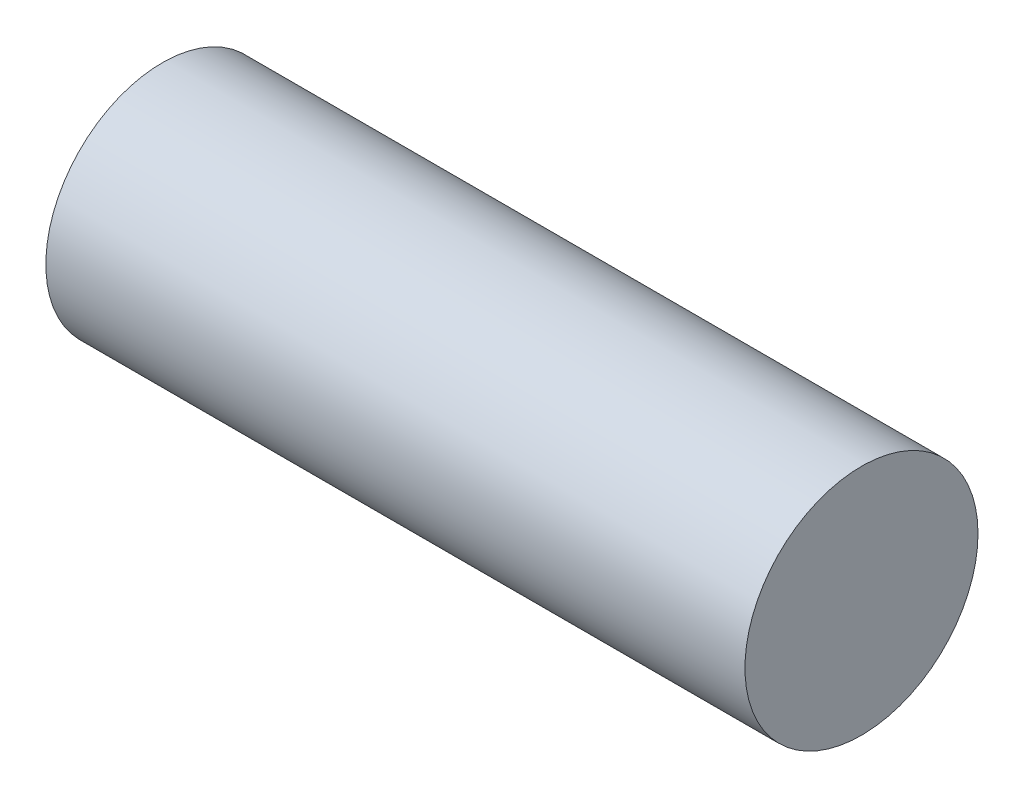
ISO-10303-21;
HEADER;
FILE_DESCRIPTION(('STEP AP214'),'2;1');
FILE_NAME('part.step','',(''),(''),'','','');
FILE_SCHEMA(('AUTOMOTIVE_DESIGN { 1 0 10303 214 1 1 1 1 }'));
ENDSEC;
DATA;
#1=APPLICATION_CONTEXT('core data for automotive mechanical design processes');
#2=APPLICATION_PROTOCOL_DEFINITION('international standard','automotive_design',2000,#1);
#3=PRODUCT_CONTEXT('',#1,'mechanical');
#4=PRODUCT('Part','Part','',(#3));
#5=PRODUCT_RELATED_PRODUCT_CATEGORY('part','',(#4));
#6=PRODUCT_DEFINITION_FORMATION('','',#4);
#7=PRODUCT_DEFINITION_CONTEXT('part definition',#1,'design');
#8=PRODUCT_DEFINITION('design','',#6,#7);
#9=PRODUCT_DEFINITION_SHAPE('','',#8);
#10=(LENGTH_UNIT() NAMED_UNIT(*) SI_UNIT(.MILLI.,.METRE.));
#11=(NAMED_UNIT(*) PLANE_ANGLE_UNIT() SI_UNIT($,.RADIAN.));
#12=(NAMED_UNIT(*) SI_UNIT($,.STERADIAN.) SOLID_ANGLE_UNIT());
#13=UNCERTAINTY_MEASURE_WITH_UNIT(LENGTH_MEASURE(1.E-05),#10,'distance_accuracy_value','');
#14=(GEOMETRIC_REPRESENTATION_CONTEXT(3) GLOBAL_UNCERTAINTY_ASSIGNED_CONTEXT((#13)) GLOBAL_UNIT_ASSIGNED_CONTEXT((#10,
#11,#12)) REPRESENTATION_CONTEXT('',''));
#15=CARTESIAN_POINT('',(0.,0.,0.));
#16=DIRECTION('',(0.,0.,1.));
#17=DIRECTION('',(1.,0.,0.));
#18=AXIS2_PLACEMENT_3D('',#15,#16,#17);
#19=CARTESIAN_POINT('',(30.,0.,0.));
#20=DIRECTION('',(-1.,0.,0.));
#21=DIRECTION('',(0.,0.,1.));
#22=AXIS2_PLACEMENT_3D('',#19,#20,#21);
#23=CYLINDRICAL_SURFACE('',#22,10.);
#24=CARTESIAN_POINT('',(30.,0.,0.));
#25=DIRECTION('',(1.,0.,0.));
#26=DIRECTION('',(0.,0.,-1.));
#27=AXIS2_PLACEMENT_3D('',#24,#25,#26);
#28=CIRCLE('',#27,10.);
#29=CARTESIAN_POINT('',(30.,0.,-10.));
#30=VERTEX_POINT('',#29);
#31=EDGE_CURVE('E10',#30,#30,#28,.T.);
#32=ORIENTED_EDGE('',*,*,#31,.F.);
#33=EDGE_LOOP('',(#32));
#34=FACE_BOUND('',#33,.T.);
#35=CARTESIAN_POINT('',(-30.,0.,0.));
#36=DIRECTION('',(1.,0.,0.));
#37=DIRECTION('',(0.,0.,-1.));
#38=AXIS2_PLACEMENT_3D('',#35,#36,#37);
#39=CIRCLE('',#38,10.);
#40=CARTESIAN_POINT('',(-30.,0.,-10.));
#41=VERTEX_POINT('',#40);
#42=EDGE_CURVE('E34',#41,#41,#39,.T.);
#43=ORIENTED_EDGE('',*,*,#42,.T.);
#44=EDGE_LOOP('',(#43));
#45=FACE_BOUND('',#44,.T.);
#46=ADVANCED_FACE('F31',(#34,#45),#23,.T.);
#47=CARTESIAN_POINT('',(30.,0.,0.));
#48=DIRECTION('',(1.,0.,0.));
#49=DIRECTION('',(0.,0.,-1.));
#50=AXIS2_PLACEMENT_3D('',#47,#48,#49);
#51=PLANE('',#50);
#52=ORIENTED_EDGE('',*,*,#31,.T.);
#53=EDGE_LOOP('',(#52));
#54=FACE_BOUND('',#53,.T.);
#55=ADVANCED_FACE('F46',(#54),#51,.T.);
#56=CARTESIAN_POINT('',(-30.,0.,0.));
#57=DIRECTION('',(1.,0.,0.));
#58=DIRECTION('',(0.,0.,-1.));
#59=AXIS2_PLACEMENT_3D('',#56,#57,#58);
#60=PLANE('',#59);
#61=ORIENTED_EDGE('',*,*,#42,.F.);
#62=EDGE_LOOP('',(#61));
#63=FACE_BOUND('',#62,.T.);
#64=ADVANCED_FACE('F44',(#63),#60,.F.);
#65=CLOSED_SHELL('',(#46,#55,#64));
#66=MANIFOLD_SOLID_BREP('B2',#65);
#67=ADVANCED_BREP_SHAPE_REPRESENTATION('',(#18,#66),#14);
#68=SHAPE_DEFINITION_REPRESENTATION(#9,#67);
ENDSEC;
END-ISO-10303-21;
